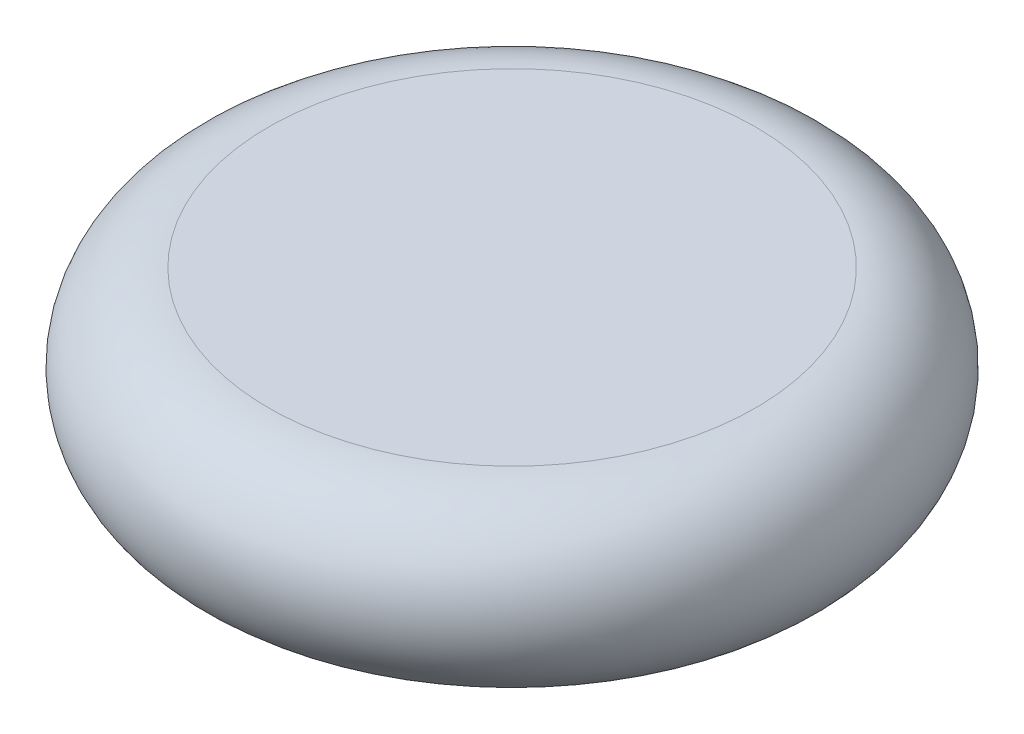
ISO-10303-21;
HEADER;
FILE_DESCRIPTION(('STEP AP214'),'2;1');
FILE_NAME('part.step','',(''),(''),'','','');
FILE_SCHEMA(('AUTOMOTIVE_DESIGN { 1 0 10303 214 1 1 1 1 }'));
ENDSEC;
DATA;
#1=APPLICATION_CONTEXT('core data for automotive mechanical design processes');
#2=APPLICATION_PROTOCOL_DEFINITION('international standard','automotive_design',2000,#1);
#3=PRODUCT_CONTEXT('',#1,'mechanical');
#4=PRODUCT('Part','Part','',(#3));
#5=PRODUCT_RELATED_PRODUCT_CATEGORY('part','',(#4));
#6=PRODUCT_DEFINITION_FORMATION('','',#4);
#7=PRODUCT_DEFINITION_CONTEXT('part definition',#1,'design');
#8=PRODUCT_DEFINITION('design','',#6,#7);
#9=PRODUCT_DEFINITION_SHAPE('','',#8);
#10=(LENGTH_UNIT() NAMED_UNIT(*) SI_UNIT(.MILLI.,.METRE.));
#11=(NAMED_UNIT(*) PLANE_ANGLE_UNIT() SI_UNIT($,.RADIAN.));
#12=(NAMED_UNIT(*) SI_UNIT($,.STERADIAN.) SOLID_ANGLE_UNIT());
#13=UNCERTAINTY_MEASURE_WITH_UNIT(LENGTH_MEASURE(1.E-05),#10,'distance_accuracy_value','');
#14=(GEOMETRIC_REPRESENTATION_CONTEXT(3) GLOBAL_UNCERTAINTY_ASSIGNED_CONTEXT((#13)) GLOBAL_UNIT_ASSIGNED_CONTEXT((#10,
#11,#12)) REPRESENTATION_CONTEXT('',''));
#15=CARTESIAN_POINT('',(0.,0.,0.));
#16=DIRECTION('',(0.,0.,1.));
#17=DIRECTION('',(1.,0.,0.));
#18=AXIS2_PLACEMENT_3D('',#15,#16,#17);
#19=CARTESIAN_POINT('',(0.,0.,0.));
#20=DIRECTION('',(0.,-1.,0.));
#21=DIRECTION('',(0.,0.,-1.));
#22=AXIS2_PLACEMENT_3D('',#19,#20,#21);
#23=PLANE('',#22);
#24=CARTESIAN_POINT('',(0.,0.,0.));
#25=DIRECTION('',(0.,-1.,0.));
#26=DIRECTION('',(0.,0.,-1.));
#27=AXIS2_PLACEMENT_3D('',#24,#25,#26);
#28=CIRCLE('',#27,20.6322209026128);
#29=CARTESIAN_POINT('',(0.,0.,-20.6322209026128));
#30=VERTEX_POINT('',#29);
#31=EDGE_CURVE('E10',#30,#30,#28,.T.);
#32=ORIENTED_EDGE('',*,*,#31,.T.);
#33=EDGE_LOOP('',(#32));
#34=FACE_BOUND('',#33,.T.);
#35=ADVANCED_FACE('F37',(#34),#23,.T.);
#36=CARTESIAN_POINT('',(0.,7.30777909738718,0.));
#37=DIRECTION('',(0.,-1.,0.));
#38=DIRECTION('',(0.,0.,-1.));
#39=AXIS2_PLACEMENT_3D('',#36,#37,#38);
#40=TOROIDAL_SURFACE('',#39,20.6322209026128,7.30777909738717);
#41=CARTESIAN_POINT('',(0.,14.6155581947743,0.));
#42=DIRECTION('',(0.,-1.,0.));
#43=DIRECTION('',(0.,0.,-1.));
#44=AXIS2_PLACEMENT_3D('',#41,#42,#43);
#45=CIRCLE('',#44,20.6322209026128);
#46=CARTESIAN_POINT('',(0.,14.6155581947743,-20.6322209026128));
#47=VERTEX_POINT('',#46);
#48=EDGE_CURVE('E44',#47,#47,#45,.T.);
#49=ORIENTED_EDGE('',*,*,#48,.T.);
#50=EDGE_LOOP('',(#49));
#51=FACE_BOUND('',#50,.T.);
#52=ORIENTED_EDGE('',*,*,#31,.F.);
#53=EDGE_LOOP('',(#52));
#54=FACE_BOUND('',#53,.T.);
#55=ADVANCED_FACE('F51',(#51,#54),#40,.T.);
#56=CARTESIAN_POINT('',(0.,14.6155581947743,0.));
#57=DIRECTION('',(0.,1.,0.));
#58=DIRECTION('',(0.,0.,1.));
#59=AXIS2_PLACEMENT_3D('',#56,#57,#58);
#60=PLANE('',#59);
#61=ORIENTED_EDGE('',*,*,#48,.F.);
#62=EDGE_LOOP('',(#61));
#63=FACE_BOUND('',#62,.T.);
#64=ADVANCED_FACE('F54',(#63),#60,.T.);
#65=CLOSED_SHELL('',(#35,#55,#64));
#66=MANIFOLD_SOLID_BREP('B2',#65);
#67=ADVANCED_BREP_SHAPE_REPRESENTATION('',(#18,#66),#14);
#68=SHAPE_DEFINITION_REPRESENTATION(#9,#67);
ENDSEC;
END-ISO-10303-21;
